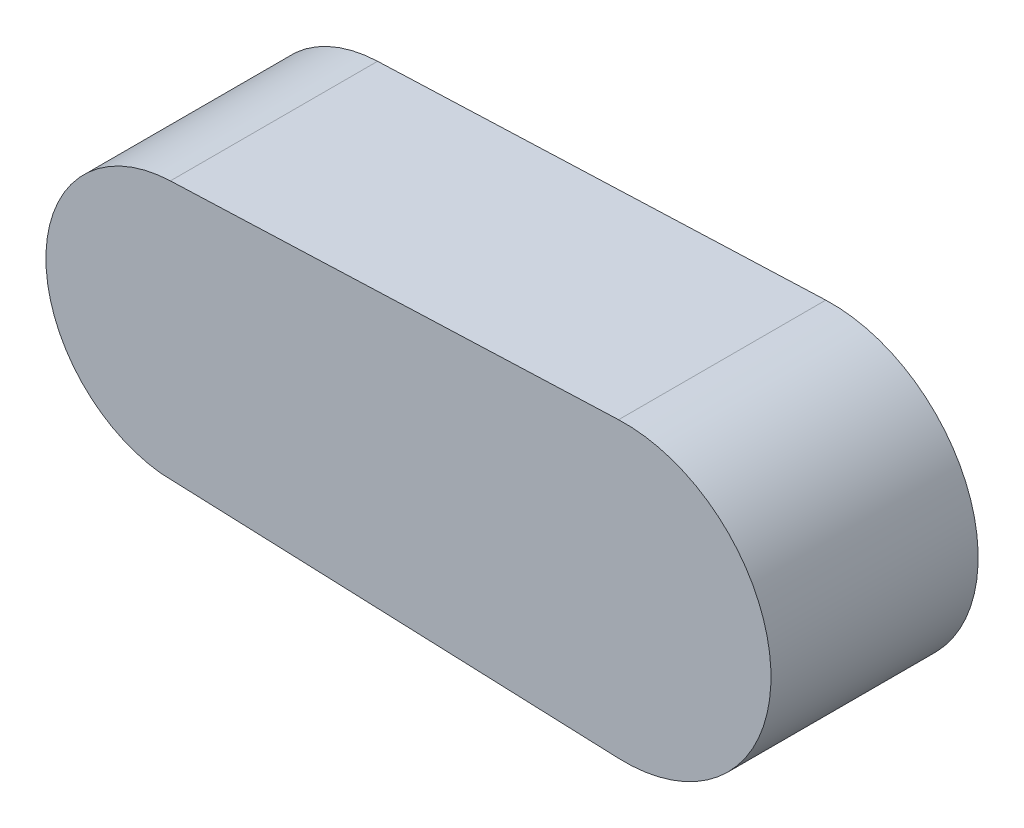
ISO-10303-21;
HEADER;
FILE_DESCRIPTION(('STEP AP214'),'2;1');
FILE_NAME('part.step','',(''),(''),'','','');
FILE_SCHEMA(('AUTOMOTIVE_DESIGN { 1 0 10303 214 1 1 1 1 }'));
ENDSEC;
DATA;
#1=APPLICATION_CONTEXT('core data for automotive mechanical design processes');
#2=APPLICATION_PROTOCOL_DEFINITION('international standard','automotive_design',2000,#1);
#3=PRODUCT_CONTEXT('',#1,'mechanical');
#4=PRODUCT('Part','Part','',(#3));
#5=PRODUCT_RELATED_PRODUCT_CATEGORY('part','',(#4));
#6=PRODUCT_DEFINITION_FORMATION('','',#4);
#7=PRODUCT_DEFINITION_CONTEXT('part definition',#1,'design');
#8=PRODUCT_DEFINITION('design','',#6,#7);
#9=PRODUCT_DEFINITION_SHAPE('','',#8);
#10=(LENGTH_UNIT() NAMED_UNIT(*) SI_UNIT(.MILLI.,.METRE.));
#11=(NAMED_UNIT(*) PLANE_ANGLE_UNIT() SI_UNIT($,.RADIAN.));
#12=(NAMED_UNIT(*) SI_UNIT($,.STERADIAN.) SOLID_ANGLE_UNIT());
#13=UNCERTAINTY_MEASURE_WITH_UNIT(LENGTH_MEASURE(1.E-05),#10,'distance_accuracy_value','');
#14=(GEOMETRIC_REPRESENTATION_CONTEXT(3) GLOBAL_UNCERTAINTY_ASSIGNED_CONTEXT((#13)) GLOBAL_UNIT_ASSIGNED_CONTEXT((#10,
#11,#12)) REPRESENTATION_CONTEXT('',''));
#15=CARTESIAN_POINT('',(0.,0.,0.));
#16=DIRECTION('',(0.,0.,1.));
#17=DIRECTION('',(1.,0.,0.));
#18=AXIS2_PLACEMENT_3D('',#15,#16,#17);
#19=CARTESIAN_POINT('',(-135.,0.,120.));
#20=DIRECTION('',(0.,0.,-1.));
#21=DIRECTION('',(-1.,0.,0.));
#22=AXIS2_PLACEMENT_3D('',#19,#20,#21);
#23=CYLINDRICAL_SURFACE('',#22,75.);
#24=CARTESIAN_POINT('',(-135.,0.,0.));
#25=DIRECTION('',(0.,0.,1.));
#26=DIRECTION('',(1.,0.,0.));
#27=AXIS2_PLACEMENT_3D('',#24,#25,#26);
#28=CIRCLE('',#27,75.);
#29=CARTESIAN_POINT('',(-137.884615384615,74.9445060967303,0.));
#30=VERTEX_POINT('',#29);
#31=CARTESIAN_POINT('',(-143.42943714608,-74.524791776967,0.));
#32=VERTEX_POINT('',#31);
#33=EDGE_CURVE('E93',#30,#32,#28,.T.);
#34=ORIENTED_EDGE('',*,*,#33,.T.);
#35=DIRECTION('',(0.,0.,-1.));
#36=VECTOR('',#35,1.);
#37=CARTESIAN_POINT('',(-143.42943714608,-74.524791776967,120.));
#38=LINE('',#37,#36);
#39=CARTESIAN_POINT('',(-143.42943714608,-74.524791776967,120.));
#40=VERTEX_POINT('',#39);
#41=EDGE_CURVE('E11',#40,#32,#38,.T.);
#42=ORIENTED_EDGE('',*,*,#41,.F.);
#43=CARTESIAN_POINT('',(-135.,0.,120.));
#44=DIRECTION('',(0.,0.,1.));
#45=DIRECTION('',(1.,0.,0.));
#46=AXIS2_PLACEMENT_3D('',#43,#44,#45);
#47=CIRCLE('',#46,75.);
#48=CARTESIAN_POINT('',(-137.884615384615,74.9445060967303,120.));
#49=VERTEX_POINT('',#48);
#50=EDGE_CURVE('E81',#49,#40,#47,.T.);
#51=ORIENTED_EDGE('',*,*,#50,.F.);
#52=DIRECTION('',(0.,0.,-1.));
#53=VECTOR('',#52,1.);
#54=CARTESIAN_POINT('',(-137.884615384615,74.9445060967303,120.));
#55=LINE('',#54,#53);
#56=EDGE_CURVE('E89',#49,#30,#55,.T.);
#57=ORIENTED_EDGE('',*,*,#56,.T.);
#58=EDGE_LOOP('',(#34,#42,#51,#57));
#59=FACE_BOUND('',#58,.T.);
#60=ADVANCED_FACE('F30',(#59),#23,.T.);
#61=CARTESIAN_POINT('',(-143.42943714608,-74.524791776967,120.));
#62=DIRECTION('',(0.0392378720212373,0.999229898171209,0.));
#63=DIRECTION('',(-0.999229898171209,0.0392378720212373,0.));
#64=AXIS2_PLACEMENT_3D('',#61,#62,#63);
#65=PLANE('',#64);
#66=DIRECTION('',(0.999229898171209,-0.0392378720212373,0.));
#67=VECTOR('',#66,1.);
#68=CARTESIAN_POINT('',(-143.42943714608,-74.524791776967,0.));
#69=LINE('',#68,#67);
#70=CARTESIAN_POINT('',(121.664780878195,-84.9345413445528,0.));
#71=VERTEX_POINT('',#70);
#72=EDGE_CURVE('E85',#32,#71,#69,.T.);
#73=ORIENTED_EDGE('',*,*,#72,.T.);
#74=DIRECTION('',(0.,0.,-1.));
#75=VECTOR('',#74,1.);
#76=CARTESIAN_POINT('',(121.664780878195,-84.9345413445528,120.));
#77=LINE('',#76,#75);
#78=CARTESIAN_POINT('',(121.664780878195,-84.9345413445528,120.));
#79=VERTEX_POINT('',#78);
#80=EDGE_CURVE('E38',#79,#71,#77,.T.);
#81=ORIENTED_EDGE('',*,*,#80,.F.);
#82=DIRECTION('',(0.999229898171209,-0.0392378720212373,0.));
#83=VECTOR('',#82,1.);
#84=CARTESIAN_POINT('',(-143.42943714608,-74.524791776967,120.));
#85=LINE('',#84,#83);
#86=EDGE_CURVE('E76',#40,#79,#85,.T.);
#87=ORIENTED_EDGE('',*,*,#86,.F.);
#88=ORIENTED_EDGE('',*,*,#41,.T.);
#89=EDGE_LOOP('',(#73,#81,#87,#88));
#90=FACE_BOUND('',#89,.T.);
#91=ADVANCED_FACE('F84',(#90),#65,.F.);
#92=CARTESIAN_POINT('',(125.,0.,120.));
#93=DIRECTION('',(0.,0.,-1.));
#94=DIRECTION('',(-1.,0.,0.));
#95=AXIS2_PLACEMENT_3D('',#92,#93,#94);
#96=CYLINDRICAL_SURFACE('',#95,85.);
#97=CARTESIAN_POINT('',(125.,0.,0.));
#98=DIRECTION('',(0.,0.,1.));
#99=DIRECTION('',(1.,0.,0.));
#100=AXIS2_PLACEMENT_3D('',#97,#98,#99);
#101=CIRCLE('',#100,85.);
#102=CARTESIAN_POINT('',(121.730769230769,84.9371069096277,0.));
#103=VERTEX_POINT('',#102);
#104=EDGE_CURVE('E63',#71,#103,#101,.T.);
#105=ORIENTED_EDGE('',*,*,#104,.T.);
#106=DIRECTION('',(0.,0.,-1.));
#107=VECTOR('',#106,1.);
#108=CARTESIAN_POINT('',(121.730769230769,84.9371069096277,120.));
#109=LINE('',#108,#107);
#110=CARTESIAN_POINT('',(121.730769230769,84.9371069096277,120.));
#111=VERTEX_POINT('',#110);
#112=EDGE_CURVE('E86',#111,#103,#109,.T.);
#113=ORIENTED_EDGE('',*,*,#112,.F.);
#114=CARTESIAN_POINT('',(125.,0.,120.));
#115=DIRECTION('',(0.,0.,1.));
#116=DIRECTION('',(1.,0.,0.));
#117=AXIS2_PLACEMENT_3D('',#114,#115,#116);
#118=CIRCLE('',#117,85.);
#119=EDGE_CURVE('E79',#79,#111,#118,.T.);
#120=ORIENTED_EDGE('',*,*,#119,.F.);
#121=ORIENTED_EDGE('',*,*,#80,.T.);
#122=EDGE_LOOP('',(#105,#113,#120,#121));
#123=FACE_BOUND('',#122,.T.);
#124=ADVANCED_FACE('F87',(#123),#96,.T.);
#125=CARTESIAN_POINT('',(-137.884615384615,74.9445060967303,120.));
#126=DIRECTION('',(0.0384615384615385,-0.999260081289737,0.));
#127=DIRECTION('',(0.999260081289737,0.0384615384615385,0.));
#128=AXIS2_PLACEMENT_3D('',#125,#126,#127);
#129=PLANE('',#128);
#130=DIRECTION('',(-0.999260081289737,-0.0384615384615385,0.));
#131=VECTOR('',#130,1.);
#132=CARTESIAN_POINT('',(-137.884615384615,74.9445060967303,0.));
#133=LINE('',#132,#131);
#134=EDGE_CURVE('E69',#103,#30,#133,.T.);
#135=ORIENTED_EDGE('',*,*,#134,.T.);
#136=ORIENTED_EDGE('',*,*,#56,.F.);
#137=DIRECTION('',(-0.999260081289737,-0.0384615384615385,0.));
#138=VECTOR('',#137,1.);
#139=CARTESIAN_POINT('',(-137.884615384615,74.9445060967303,120.));
#140=LINE('',#139,#138);
#141=EDGE_CURVE('E46',#111,#49,#140,.T.);
#142=ORIENTED_EDGE('',*,*,#141,.F.);
#143=ORIENTED_EDGE('',*,*,#112,.T.);
#144=EDGE_LOOP('',(#135,#136,#142,#143));
#145=FACE_BOUND('',#144,.T.);
#146=ADVANCED_FACE('F100',(#145),#129,.F.);
#147=CARTESIAN_POINT('',(-135.,0.,120.));
#148=DIRECTION('',(0.,0.,1.));
#149=DIRECTION('',(1.,0.,0.));
#150=AXIS2_PLACEMENT_3D('',#147,#148,#149);
#151=PLANE('',#150);
#152=ORIENTED_EDGE('',*,*,#50,.T.);
#153=ORIENTED_EDGE('',*,*,#86,.T.);
#154=ORIENTED_EDGE('',*,*,#119,.T.);
#155=ORIENTED_EDGE('',*,*,#141,.T.);
#156=EDGE_LOOP('',(#152,#153,#154,#155));
#157=FACE_BOUND('',#156,.T.);
#158=ADVANCED_FACE('F77',(#157),#151,.T.);
#159=CARTESIAN_POINT('',(-135.,0.,0.));
#160=DIRECTION('',(0.,0.,1.));
#161=DIRECTION('',(1.,0.,0.));
#162=AXIS2_PLACEMENT_3D('',#159,#160,#161);
#163=PLANE('',#162);
#164=ORIENTED_EDGE('',*,*,#33,.F.);
#165=ORIENTED_EDGE('',*,*,#134,.F.);
#166=ORIENTED_EDGE('',*,*,#104,.F.);
#167=ORIENTED_EDGE('',*,*,#72,.F.);
#168=EDGE_LOOP('',(#164,#165,#166,#167));
#169=FACE_BOUND('',#168,.T.);
#170=ADVANCED_FACE('F103',(#169),#163,.F.);
#171=CLOSED_SHELL('',(#60,#91,#124,#146,#158,#170));
#172=MANIFOLD_SOLID_BREP('B2',#171);
#173=ADVANCED_BREP_SHAPE_REPRESENTATION('',(#18,#172),#14);
#174=SHAPE_DEFINITION_REPRESENTATION(#9,#173);
ENDSEC;
END-ISO-10303-21;
